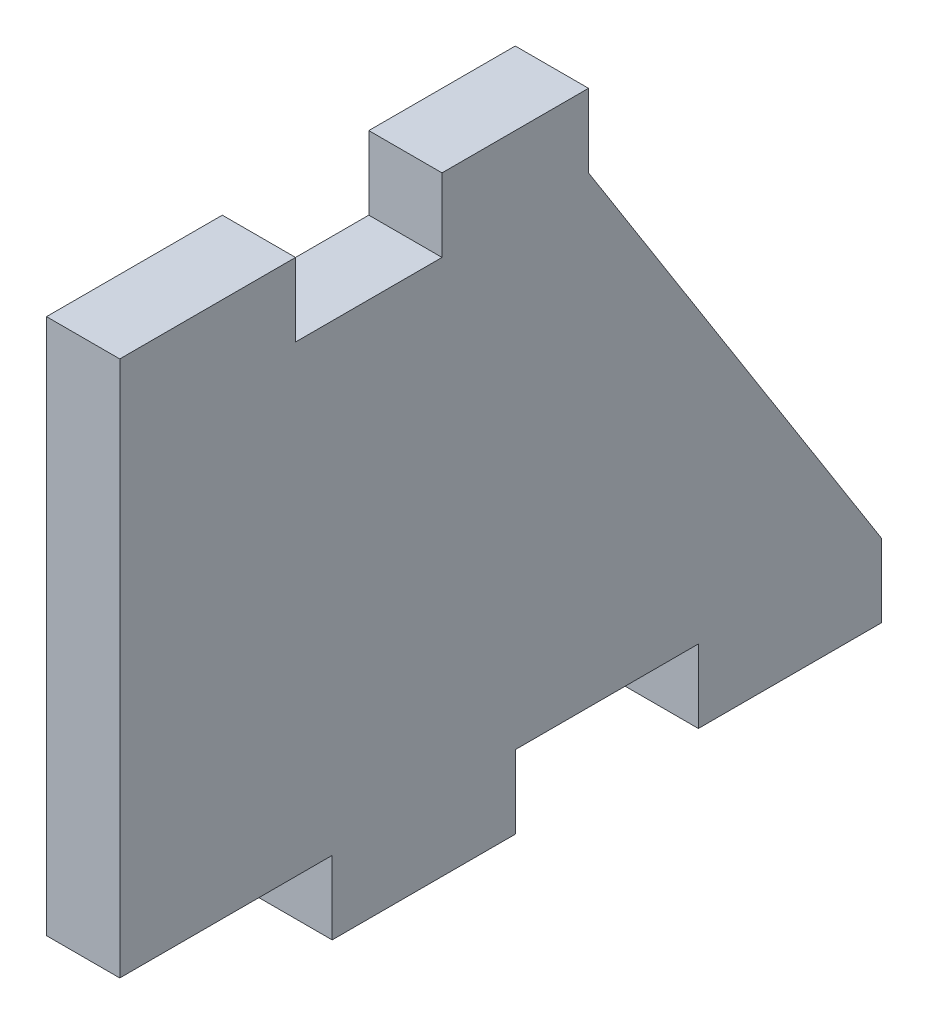
ISO-10303-21;
HEADER;
FILE_DESCRIPTION(('STEP AP214'),'2;1');
FILE_NAME('part.step','',(''),(''),'','','');
FILE_SCHEMA(('AUTOMOTIVE_DESIGN { 1 0 10303 214 1 1 1 1 }'));
ENDSEC;
DATA;
#1=APPLICATION_CONTEXT('core data for automotive mechanical design processes');
#2=APPLICATION_PROTOCOL_DEFINITION('international standard','automotive_design',2000,#1);
#3=PRODUCT_CONTEXT('',#1,'mechanical');
#4=PRODUCT('Part','Part','',(#3));
#5=PRODUCT_RELATED_PRODUCT_CATEGORY('part','',(#4));
#6=PRODUCT_DEFINITION_FORMATION('','',#4);
#7=PRODUCT_DEFINITION_CONTEXT('part definition',#1,'design');
#8=PRODUCT_DEFINITION('design','',#6,#7);
#9=PRODUCT_DEFINITION_SHAPE('','',#8);
#10=(LENGTH_UNIT() NAMED_UNIT(*) SI_UNIT(.MILLI.,.METRE.));
#11=(NAMED_UNIT(*) PLANE_ANGLE_UNIT() SI_UNIT($,.RADIAN.));
#12=(NAMED_UNIT(*) SI_UNIT($,.STERADIAN.) SOLID_ANGLE_UNIT());
#13=UNCERTAINTY_MEASURE_WITH_UNIT(LENGTH_MEASURE(1.E-05),#10,'distance_accuracy_value','');
#14=(GEOMETRIC_REPRESENTATION_CONTEXT(3) GLOBAL_UNCERTAINTY_ASSIGNED_CONTEXT((#13)) GLOBAL_UNIT_ASSIGNED_CONTEXT((#10,
#11,#12)) REPRESENTATION_CONTEXT('',''));
#15=CARTESIAN_POINT('',(0.,0.,0.));
#16=DIRECTION('',(0.,0.,1.));
#17=DIRECTION('',(1.,0.,0.));
#18=AXIS2_PLACEMENT_3D('',#15,#16,#17);
#19=CARTESIAN_POINT('',(6.35,-20.066,31.75));
#20=DIRECTION('',(0.,1.,0.));
#21=DIRECTION('',(0.,0.,1.));
#22=AXIS2_PLACEMENT_3D('',#19,#20,#21);
#23=PLANE('',#22);
#24=DIRECTION('',(-1.,0.,0.));
#25=VECTOR('',#24,1.);
#26=CARTESIAN_POINT('',(6.35,-20.066,15.875));
#27=LINE('',#26,#25);
#28=CARTESIAN_POINT('',(6.35,-20.066,15.875));
#29=VERTEX_POINT('',#28);
#30=CARTESIAN_POINT('',(0.,-20.066,15.875));
#31=VERTEX_POINT('',#30);
#32=EDGE_CURVE('E208',#29,#31,#27,.T.);
#33=ORIENTED_EDGE('',*,*,#32,.F.);
#34=DIRECTION('',(0.,0.,-1.));
#35=VECTOR('',#34,1.);
#36=CARTESIAN_POINT('',(6.35,-20.066,31.75));
#37=LINE('',#36,#35);
#38=CARTESIAN_POINT('',(6.35,-20.066,34.29));
#39=VERTEX_POINT('',#38);
#40=EDGE_CURVE('E43',#39,#29,#37,.T.);
#41=ORIENTED_EDGE('',*,*,#40,.F.);
#42=DIRECTION('',(1.,0.,0.));
#43=VECTOR('',#42,1.);
#44=CARTESIAN_POINT('',(0.,-20.066,34.29));
#45=LINE('',#44,#43);
#46=CARTESIAN_POINT('',(0.,-20.066,34.29));
#47=VERTEX_POINT('',#46);
#48=EDGE_CURVE('E170',#47,#39,#45,.T.);
#49=ORIENTED_EDGE('',*,*,#48,.F.);
#50=DIRECTION('',(0.,0.,-1.));
#51=VECTOR('',#50,1.);
#52=CARTESIAN_POINT('',(0.,-20.066,31.75));
#53=LINE('',#52,#51);
#54=EDGE_CURVE('E175',#47,#31,#53,.T.);
#55=ORIENTED_EDGE('',*,*,#54,.T.);
#56=EDGE_LOOP('',(#33,#41,#49,#55));
#57=FACE_BOUND('',#56,.T.);
#58=ADVANCED_FACE('F34',(#57),#23,.F.);
#59=CARTESIAN_POINT('',(6.35,20.066,31.75));
#60=DIRECTION('',(0.,-1.,0.));
#61=DIRECTION('',(0.,0.,-1.));
#62=AXIS2_PLACEMENT_3D('',#59,#60,#61);
#63=PLANE('',#62);
#64=DIRECTION('',(0.,0.,1.));
#65=VECTOR('',#64,1.);
#66=CARTESIAN_POINT('',(6.35,20.066,31.75));
#67=LINE('',#66,#65);
#68=CARTESIAN_POINT('',(6.35,20.066,6.35000000000002));
#69=VERTEX_POINT('',#68);
#70=CARTESIAN_POINT('',(6.35,20.066,19.05));
#71=VERTEX_POINT('',#70);
#72=EDGE_CURVE('E59',#69,#71,#67,.T.);
#73=ORIENTED_EDGE('',*,*,#72,.F.);
#74=DIRECTION('',(-1.,0.,0.));
#75=VECTOR('',#74,1.);
#76=CARTESIAN_POINT('',(6.35,20.066,6.35000000000002));
#77=LINE('',#76,#75);
#78=CARTESIAN_POINT('',(0.,20.066,6.35000000000002));
#79=VERTEX_POINT('',#78);
#80=EDGE_CURVE('E310',#69,#79,#77,.T.);
#81=ORIENTED_EDGE('',*,*,#80,.T.);
#82=DIRECTION('',(0.,0.,1.));
#83=VECTOR('',#82,1.);
#84=CARTESIAN_POINT('',(0.,20.066,31.75));
#85=LINE('',#84,#83);
#86=CARTESIAN_POINT('',(0.,20.066,19.05));
#87=VERTEX_POINT('',#86);
#88=EDGE_CURVE('E255',#79,#87,#85,.T.);
#89=ORIENTED_EDGE('',*,*,#88,.T.);
#90=DIRECTION('',(-1.,0.,0.));
#91=VECTOR('',#90,1.);
#92=CARTESIAN_POINT('',(6.35,20.066,19.05));
#93=LINE('',#92,#91);
#94=EDGE_CURVE('E293',#71,#87,#93,.T.);
#95=ORIENTED_EDGE('',*,*,#94,.F.);
#96=EDGE_LOOP('',(#73,#81,#89,#95));
#97=FACE_BOUND('',#96,.T.);
#98=ADVANCED_FACE('F36',(#97),#63,.F.);
#99=CARTESIAN_POINT('',(0.,-20.066,0.));
#100=VERTEX_POINT('',#99);
#101=CARTESIAN_POINT('',(0.,-20.066,-15.875));
#102=VERTEX_POINT('',#101);
#103=EDGE_CURVE('E258',#100,#102,#53,.T.);
#104=ORIENTED_EDGE('',*,*,#103,.T.);
#105=DIRECTION('',(-1.,0.,0.));
#106=VECTOR('',#105,1.);
#107=CARTESIAN_POINT('',(6.35,-20.066,-15.875));
#108=LINE('',#107,#106);
#109=CARTESIAN_POINT('',(6.35,-20.066,-15.875));
#110=VERTEX_POINT('',#109);
#111=EDGE_CURVE('E199',#110,#102,#108,.T.);
#112=ORIENTED_EDGE('',*,*,#111,.F.);
#113=CARTESIAN_POINT('',(6.35,-20.066,0.));
#114=VERTEX_POINT('',#113);
#115=EDGE_CURVE('E240',#114,#110,#37,.T.);
#116=ORIENTED_EDGE('',*,*,#115,.F.);
#117=DIRECTION('',(-1.,0.,0.));
#118=VECTOR('',#117,1.);
#119=CARTESIAN_POINT('',(6.35,-20.066,0.));
#120=LINE('',#119,#118);
#121=EDGE_CURVE('E219',#114,#100,#120,.T.);
#122=ORIENTED_EDGE('',*,*,#121,.T.);
#123=EDGE_LOOP('',(#104,#112,#116,#122));
#124=FACE_BOUND('',#123,.T.);
#125=ADVANCED_FACE('F266',(#124),#23,.F.);
#126=CARTESIAN_POINT('',(6.35,20.066,-31.75));
#127=DIRECTION('',(-1.,0.,0.));
#128=DIRECTION('',(0.,0.,1.));
#129=AXIS2_PLACEMENT_3D('',#126,#127,#128);
#130=PLANE('',#129);
#131=DIRECTION('',(0.,0.,-1.));
#132=VECTOR('',#131,1.);
#133=CARTESIAN_POINT('',(6.35,26.416,31.75));
#134=LINE('',#133,#132);
#135=CARTESIAN_POINT('',(6.35,26.416,34.29));
#136=VERTEX_POINT('',#135);
#137=CARTESIAN_POINT('',(6.35,26.416,19.05));
#138=VERTEX_POINT('',#137);
#139=EDGE_CURVE('E304',#136,#138,#134,.T.);
#140=ORIENTED_EDGE('',*,*,#139,.F.);
#141=DIRECTION('',(0.,-1.,0.));
#142=VECTOR('',#141,1.);
#143=CARTESIAN_POINT('',(6.35,26.416,34.29));
#144=LINE('',#143,#142);
#145=EDGE_CURVE('E169',#136,#39,#144,.T.);
#146=ORIENTED_EDGE('',*,*,#145,.T.);
#147=ORIENTED_EDGE('',*,*,#40,.T.);
#148=DIRECTION('',(0.,1.,0.));
#149=VECTOR('',#148,1.);
#150=CARTESIAN_POINT('',(6.35,-20.066,15.875));
#151=LINE('',#150,#149);
#152=CARTESIAN_POINT('',(6.35,-26.416,15.875));
#153=VERTEX_POINT('',#152);
#154=EDGE_CURVE('E213',#153,#29,#151,.T.);
#155=ORIENTED_EDGE('',*,*,#154,.F.);
#156=DIRECTION('',(0.,0.,1.));
#157=VECTOR('',#156,1.);
#158=CARTESIAN_POINT('',(6.35,-26.416,15.875));
#159=LINE('',#158,#157);
#160=CARTESIAN_POINT('',(6.35,-26.416,0.));
#161=VERTEX_POINT('',#160);
#162=EDGE_CURVE('E205',#161,#153,#159,.T.);
#163=ORIENTED_EDGE('',*,*,#162,.F.);
#164=DIRECTION('',(0.,-1.,0.));
#165=VECTOR('',#164,1.);
#166=CARTESIAN_POINT('',(6.35,-20.066,0.));
#167=LINE('',#166,#165);
#168=EDGE_CURVE('E209',#114,#161,#167,.T.);
#169=ORIENTED_EDGE('',*,*,#168,.F.);
#170=ORIENTED_EDGE('',*,*,#115,.T.);
#171=DIRECTION('',(0.,1.,0.));
#172=VECTOR('',#171,1.);
#173=CARTESIAN_POINT('',(6.35,-20.066,-15.875));
#174=LINE('',#173,#172);
#175=CARTESIAN_POINT('',(6.35,-26.416,-15.875));
#176=VERTEX_POINT('',#175);
#177=EDGE_CURVE('E189',#176,#110,#174,.T.);
#178=ORIENTED_EDGE('',*,*,#177,.F.);
#179=DIRECTION('',(0.,0.,1.));
#180=VECTOR('',#179,1.);
#181=CARTESIAN_POINT('',(6.35,-26.416,-31.75));
#182=LINE('',#181,#180);
#183=CARTESIAN_POINT('',(6.35,-26.416,-31.75));
#184=VERTEX_POINT('',#183);
#185=EDGE_CURVE('E185',#184,#176,#182,.T.);
#186=ORIENTED_EDGE('',*,*,#185,.F.);
#187=DIRECTION('',(0.,-1.,0.));
#188=VECTOR('',#187,1.);
#189=CARTESIAN_POINT('',(6.35,-20.066,-31.75));
#190=LINE('',#189,#188);
#191=CARTESIAN_POINT('',(6.35,-20.066,-31.75));
#192=VERTEX_POINT('',#191);
#193=EDGE_CURVE('E182',#192,#184,#190,.T.);
#194=ORIENTED_EDGE('',*,*,#193,.F.);
#195=DIRECTION('',(0.,0.84498019748951,0.534797593347791));
#196=VECTOR('',#195,1.);
#197=CARTESIAN_POINT('',(6.35,-20.066,-31.75));
#198=LINE('',#197,#196);
#199=CARTESIAN_POINT('',(6.35,20.066,-6.34999999999998));
#200=VERTEX_POINT('',#199);
#201=EDGE_CURVE('E285',#192,#200,#198,.T.);
#202=ORIENTED_EDGE('',*,*,#201,.T.);
#203=DIRECTION('',(0.,-1.,0.));
#204=VECTOR('',#203,1.);
#205=CARTESIAN_POINT('',(6.35,20.066,-6.34999999999998));
#206=LINE('',#205,#204);
#207=CARTESIAN_POINT('',(6.35,26.416,-6.34999999999998));
#208=VERTEX_POINT('',#207);
#209=EDGE_CURVE('E319',#208,#200,#206,.T.);
#210=ORIENTED_EDGE('',*,*,#209,.F.);
#211=DIRECTION('',(0.,0.,-1.));
#212=VECTOR('',#211,1.);
#213=CARTESIAN_POINT('',(6.35,26.416,-6.34999999999998));
#214=LINE('',#213,#212);
#215=CARTESIAN_POINT('',(6.35,26.416,6.35000000000002));
#216=VERTEX_POINT('',#215);
#217=EDGE_CURVE('E313',#216,#208,#214,.T.);
#218=ORIENTED_EDGE('',*,*,#217,.F.);
#219=DIRECTION('',(0.,1.,0.));
#220=VECTOR('',#219,1.);
#221=CARTESIAN_POINT('',(6.35,20.066,6.35000000000002));
#222=LINE('',#221,#220);
#223=EDGE_CURVE('E327',#69,#216,#222,.T.);
#224=ORIENTED_EDGE('',*,*,#223,.F.);
#225=ORIENTED_EDGE('',*,*,#72,.T.);
#226=DIRECTION('',(0.,-1.,0.));
#227=VECTOR('',#226,1.);
#228=CARTESIAN_POINT('',(6.35,20.066,19.05));
#229=LINE('',#228,#227);
#230=EDGE_CURVE('E297',#138,#71,#229,.T.);
#231=ORIENTED_EDGE('',*,*,#230,.F.);
#232=EDGE_LOOP('',(#140,#146,#147,#155,#163,#169,#170,#178,#186,#194,#202,#210,#218,#224,#225,#231));
#233=FACE_BOUND('',#232,.T.);
#234=ADVANCED_FACE('F275',(#233),#130,.F.);
#235=CARTESIAN_POINT('',(0.,20.066,-31.75));
#236=DIRECTION('',(-1.,0.,0.));
#237=DIRECTION('',(0.,0.,1.));
#238=AXIS2_PLACEMENT_3D('',#235,#236,#237);
#239=PLANE('',#238);
#240=ORIENTED_EDGE('',*,*,#54,.F.);
#241=DIRECTION('',(0.,-1.,0.));
#242=VECTOR('',#241,1.);
#243=CARTESIAN_POINT('',(0.,26.416,34.29));
#244=LINE('',#243,#242);
#245=CARTESIAN_POINT('',(0.,26.416,34.29));
#246=VERTEX_POINT('',#245);
#247=EDGE_CURVE('E167',#246,#47,#244,.T.);
#248=ORIENTED_EDGE('',*,*,#247,.F.);
#249=DIRECTION('',(0.,0.,-1.));
#250=VECTOR('',#249,1.);
#251=CARTESIAN_POINT('',(0.,26.416,31.75));
#252=LINE('',#251,#250);
#253=CARTESIAN_POINT('',(0.,26.416,19.05));
#254=VERTEX_POINT('',#253);
#255=EDGE_CURVE('E149',#246,#254,#252,.T.);
#256=ORIENTED_EDGE('',*,*,#255,.T.);
#257=DIRECTION('',(0.,-1.,0.));
#258=VECTOR('',#257,1.);
#259=CARTESIAN_POINT('',(0.,20.066,19.05));
#260=LINE('',#259,#258);
#261=EDGE_CURVE('E160',#254,#87,#260,.T.);
#262=ORIENTED_EDGE('',*,*,#261,.T.);
#263=ORIENTED_EDGE('',*,*,#88,.F.);
#264=DIRECTION('',(0.,1.,0.));
#265=VECTOR('',#264,1.);
#266=CARTESIAN_POINT('',(0.,20.066,6.35000000000002));
#267=LINE('',#266,#265);
#268=CARTESIAN_POINT('',(0.,26.416,6.35000000000002));
#269=VERTEX_POINT('',#268);
#270=EDGE_CURVE('E320',#79,#269,#267,.T.);
#271=ORIENTED_EDGE('',*,*,#270,.T.);
#272=DIRECTION('',(0.,0.,-1.));
#273=VECTOR('',#272,1.);
#274=CARTESIAN_POINT('',(0.,26.416,-6.34999999999998));
#275=LINE('',#274,#273);
#276=CARTESIAN_POINT('',(0.,26.416,-6.34999999999998));
#277=VERTEX_POINT('',#276);
#278=EDGE_CURVE('E316',#269,#277,#275,.T.);
#279=ORIENTED_EDGE('',*,*,#278,.T.);
#280=DIRECTION('',(0.,-1.,0.));
#281=VECTOR('',#280,1.);
#282=CARTESIAN_POINT('',(0.,20.066,-6.34999999999998));
#283=LINE('',#282,#281);
#284=CARTESIAN_POINT('',(0.,20.066,-6.34999999999998));
#285=VERTEX_POINT('',#284);
#286=EDGE_CURVE('E216',#277,#285,#283,.T.);
#287=ORIENTED_EDGE('',*,*,#286,.T.);
#288=DIRECTION('',(0.,0.84498019748951,0.534797593347791));
#289=VECTOR('',#288,1.);
#290=CARTESIAN_POINT('',(0.,-20.066,-31.75));
#291=LINE('',#290,#289);
#292=CARTESIAN_POINT('',(0.,-20.066,-31.75));
#293=VERTEX_POINT('',#292);
#294=EDGE_CURVE('E291',#293,#285,#291,.T.);
#295=ORIENTED_EDGE('',*,*,#294,.F.);
#296=DIRECTION('',(0.,-1.,0.));
#297=VECTOR('',#296,1.);
#298=CARTESIAN_POINT('',(0.,-20.066,-31.75));
#299=LINE('',#298,#297);
#300=CARTESIAN_POINT('',(0.,-26.416,-31.75));
#301=VERTEX_POINT('',#300);
#302=EDGE_CURVE('E180',#293,#301,#299,.T.);
#303=ORIENTED_EDGE('',*,*,#302,.T.);
#304=DIRECTION('',(0.,0.,1.));
#305=VECTOR('',#304,1.);
#306=CARTESIAN_POINT('',(0.,-26.416,-31.75));
#307=LINE('',#306,#305);
#308=CARTESIAN_POINT('',(0.,-26.416,-15.875));
#309=VERTEX_POINT('',#308);
#310=EDGE_CURVE('E194',#301,#309,#307,.T.);
#311=ORIENTED_EDGE('',*,*,#310,.T.);
#312=DIRECTION('',(0.,1.,0.));
#313=VECTOR('',#312,1.);
#314=CARTESIAN_POINT('',(0.,-20.066,-15.875));
#315=LINE('',#314,#313);
#316=EDGE_CURVE('E186',#309,#102,#315,.T.);
#317=ORIENTED_EDGE('',*,*,#316,.T.);
#318=ORIENTED_EDGE('',*,*,#103,.F.);
#319=DIRECTION('',(0.,-1.,0.));
#320=VECTOR('',#319,1.);
#321=CARTESIAN_POINT('',(0.,-20.066,0.));
#322=LINE('',#321,#320);
#323=CARTESIAN_POINT('',(0.,-26.416,0.));
#324=VERTEX_POINT('',#323);
#325=EDGE_CURVE('E51',#100,#324,#322,.T.);
#326=ORIENTED_EDGE('',*,*,#325,.T.);
#327=DIRECTION('',(0.,0.,1.));
#328=VECTOR('',#327,1.);
#329=CARTESIAN_POINT('',(0.,-26.416,15.875));
#330=LINE('',#329,#328);
#331=CARTESIAN_POINT('',(0.,-26.416,15.875));
#332=VERTEX_POINT('',#331);
#333=EDGE_CURVE('E210',#324,#332,#330,.T.);
#334=ORIENTED_EDGE('',*,*,#333,.T.);
#335=DIRECTION('',(0.,1.,0.));
#336=VECTOR('',#335,1.);
#337=CARTESIAN_POINT('',(0.,-20.066,15.875));
#338=LINE('',#337,#336);
#339=EDGE_CURVE('E201',#332,#31,#338,.T.);
#340=ORIENTED_EDGE('',*,*,#339,.T.);
#341=EDGE_LOOP('',(#240,#248,#256,#262,#263,#271,#279,#287,#295,#303,#311,#317,#318,#326,#334,#340));
#342=FACE_BOUND('',#341,.T.);
#343=ADVANCED_FACE('F172',(#342),#239,.T.);
#344=CARTESIAN_POINT('',(6.35,-20.066,-31.75));
#345=DIRECTION('',(0.,-0.534797593347791,0.84498019748951));
#346=DIRECTION('',(0.,-0.84498019748951,-0.534797593347791));
#347=AXIS2_PLACEMENT_3D('',#344,#345,#346);
#348=PLANE('',#347);
#349=ORIENTED_EDGE('',*,*,#294,.T.);
#350=DIRECTION('',(-1.,0.,0.));
#351=VECTOR('',#350,1.);
#352=CARTESIAN_POINT('',(6.35,20.066,-6.34999999999998));
#353=LINE('',#352,#351);
#354=EDGE_CURVE('E259',#200,#285,#353,.T.);
#355=ORIENTED_EDGE('',*,*,#354,.F.);
#356=ORIENTED_EDGE('',*,*,#201,.F.);
#357=DIRECTION('',(-1.,0.,0.));
#358=VECTOR('',#357,1.);
#359=CARTESIAN_POINT('',(6.35,-20.066,-31.75));
#360=LINE('',#359,#358);
#361=EDGE_CURVE('E11',#192,#293,#360,.T.);
#362=ORIENTED_EDGE('',*,*,#361,.T.);
#363=EDGE_LOOP('',(#349,#355,#356,#362));
#364=FACE_BOUND('',#363,.T.);
#365=ADVANCED_FACE('F288',(#364),#348,.F.);
#366=CARTESIAN_POINT('',(6.35,20.066,19.05));
#367=DIRECTION('',(0.,0.,-1.));
#368=DIRECTION('',(-1.,0.,0.));
#369=AXIS2_PLACEMENT_3D('',#366,#367,#368);
#370=PLANE('',#369);
#371=ORIENTED_EDGE('',*,*,#261,.F.);
#372=DIRECTION('',(-1.,0.,0.));
#373=VECTOR('',#372,1.);
#374=CARTESIAN_POINT('',(6.35,26.416,19.05));
#375=LINE('',#374,#373);
#376=EDGE_CURVE('E155',#138,#254,#375,.T.);
#377=ORIENTED_EDGE('',*,*,#376,.F.);
#378=ORIENTED_EDGE('',*,*,#230,.T.);
#379=ORIENTED_EDGE('',*,*,#94,.T.);
#380=EDGE_LOOP('',(#371,#377,#378,#379));
#381=FACE_BOUND('',#380,.T.);
#382=ADVANCED_FACE('F341',(#381),#370,.T.);
#383=CARTESIAN_POINT('',(6.35,26.416,31.75));
#384=DIRECTION('',(0.,1.,0.));
#385=DIRECTION('',(0.,0.,1.));
#386=AXIS2_PLACEMENT_3D('',#383,#384,#385);
#387=PLANE('',#386);
#388=ORIENTED_EDGE('',*,*,#255,.F.);
#389=DIRECTION('',(1.,0.,0.));
#390=VECTOR('',#389,1.);
#391=CARTESIAN_POINT('',(0.,26.416,34.29));
#392=LINE('',#391,#390);
#393=EDGE_CURVE('E153',#246,#136,#392,.T.);
#394=ORIENTED_EDGE('',*,*,#393,.T.);
#395=ORIENTED_EDGE('',*,*,#139,.T.);
#396=ORIENTED_EDGE('',*,*,#376,.T.);
#397=EDGE_LOOP('',(#388,#394,#395,#396));
#398=FACE_BOUND('',#397,.T.);
#399=ADVANCED_FACE('F151',(#398),#387,.T.);
#400=CARTESIAN_POINT('',(6.35,20.066,-6.34999999999998));
#401=DIRECTION('',(0.,0.,-1.));
#402=DIRECTION('',(-1.,0.,0.));
#403=AXIS2_PLACEMENT_3D('',#400,#401,#402);
#404=PLANE('',#403);
#405=ORIENTED_EDGE('',*,*,#286,.F.);
#406=DIRECTION('',(-1.,0.,0.));
#407=VECTOR('',#406,1.);
#408=CARTESIAN_POINT('',(6.35,26.416,-6.34999999999998));
#409=LINE('',#408,#407);
#410=EDGE_CURVE('E161',#208,#277,#409,.T.);
#411=ORIENTED_EDGE('',*,*,#410,.F.);
#412=ORIENTED_EDGE('',*,*,#209,.T.);
#413=ORIENTED_EDGE('',*,*,#354,.T.);
#414=EDGE_LOOP('',(#405,#411,#412,#413));
#415=FACE_BOUND('',#414,.T.);
#416=ADVANCED_FACE('F331',(#415),#404,.T.);
#417=CARTESIAN_POINT('',(6.35,26.416,-6.34999999999998));
#418=DIRECTION('',(0.,1.,0.));
#419=DIRECTION('',(0.,0.,1.));
#420=AXIS2_PLACEMENT_3D('',#417,#418,#419);
#421=PLANE('',#420);
#422=ORIENTED_EDGE('',*,*,#278,.F.);
#423=DIRECTION('',(-1.,0.,0.));
#424=VECTOR('',#423,1.);
#425=CARTESIAN_POINT('',(6.35,26.416,6.35000000000002));
#426=LINE('',#425,#424);
#427=EDGE_CURVE('E312',#216,#269,#426,.T.);
#428=ORIENTED_EDGE('',*,*,#427,.F.);
#429=ORIENTED_EDGE('',*,*,#217,.T.);
#430=ORIENTED_EDGE('',*,*,#410,.T.);
#431=EDGE_LOOP('',(#422,#428,#429,#430));
#432=FACE_BOUND('',#431,.T.);
#433=ADVANCED_FACE('F336',(#432),#421,.T.);
#434=CARTESIAN_POINT('',(6.35,20.066,6.35000000000002));
#435=DIRECTION('',(0.,0.,1.));
#436=DIRECTION('',(1.,0.,0.));
#437=AXIS2_PLACEMENT_3D('',#434,#435,#436);
#438=PLANE('',#437);
#439=ORIENTED_EDGE('',*,*,#270,.F.);
#440=ORIENTED_EDGE('',*,*,#80,.F.);
#441=ORIENTED_EDGE('',*,*,#223,.T.);
#442=ORIENTED_EDGE('',*,*,#427,.T.);
#443=EDGE_LOOP('',(#439,#440,#441,#442));
#444=FACE_BOUND('',#443,.T.);
#445=ADVANCED_FACE('F339',(#444),#438,.T.);
#446=CARTESIAN_POINT('',(6.35,-20.066,15.875));
#447=DIRECTION('',(0.,0.,1.));
#448=DIRECTION('',(1.,0.,0.));
#449=AXIS2_PLACEMENT_3D('',#446,#447,#448);
#450=PLANE('',#449);
#451=ORIENTED_EDGE('',*,*,#339,.F.);
#452=DIRECTION('',(-1.,0.,0.));
#453=VECTOR('',#452,1.);
#454=CARTESIAN_POINT('',(6.35,-26.416,15.875));
#455=LINE('',#454,#453);
#456=EDGE_CURVE('E214',#153,#332,#455,.T.);
#457=ORIENTED_EDGE('',*,*,#456,.F.);
#458=ORIENTED_EDGE('',*,*,#154,.T.);
#459=ORIENTED_EDGE('',*,*,#32,.T.);
#460=EDGE_LOOP('',(#451,#457,#458,#459));
#461=FACE_BOUND('',#460,.T.);
#462=ADVANCED_FACE('F450',(#461),#450,.T.);
#463=CARTESIAN_POINT('',(6.35,-26.416,15.875));
#464=DIRECTION('',(0.,-1.,0.));
#465=DIRECTION('',(0.,0.,-1.));
#466=AXIS2_PLACEMENT_3D('',#463,#464,#465);
#467=PLANE('',#466);
#468=ORIENTED_EDGE('',*,*,#333,.F.);
#469=DIRECTION('',(-1.,0.,0.));
#470=VECTOR('',#469,1.);
#471=CARTESIAN_POINT('',(6.35,-26.416,0.));
#472=LINE('',#471,#470);
#473=EDGE_CURVE('E217',#161,#324,#472,.T.);
#474=ORIENTED_EDGE('',*,*,#473,.F.);
#475=ORIENTED_EDGE('',*,*,#162,.T.);
#476=ORIENTED_EDGE('',*,*,#456,.T.);
#477=EDGE_LOOP('',(#468,#474,#475,#476));
#478=FACE_BOUND('',#477,.T.);
#479=ADVANCED_FACE('F442',(#478),#467,.T.);
#480=CARTESIAN_POINT('',(6.35,-20.066,0.));
#481=DIRECTION('',(0.,0.,-1.));
#482=DIRECTION('',(0.,1.,0.));
#483=AXIS2_PLACEMENT_3D('',#480,#481,#482);
#484=PLANE('',#483);
#485=ORIENTED_EDGE('',*,*,#325,.F.);
#486=ORIENTED_EDGE('',*,*,#121,.F.);
#487=ORIENTED_EDGE('',*,*,#168,.T.);
#488=ORIENTED_EDGE('',*,*,#473,.T.);
#489=EDGE_LOOP('',(#485,#486,#487,#488));
#490=FACE_BOUND('',#489,.T.);
#491=ADVANCED_FACE('F434',(#490),#484,.T.);
#492=CARTESIAN_POINT('',(6.35,-20.066,-31.75));
#493=DIRECTION('',(0.,0.,-1.));
#494=DIRECTION('',(-1.,0.,0.));
#495=AXIS2_PLACEMENT_3D('',#492,#493,#494);
#496=PLANE('',#495);
#497=ORIENTED_EDGE('',*,*,#302,.F.);
#498=ORIENTED_EDGE('',*,*,#361,.F.);
#499=ORIENTED_EDGE('',*,*,#193,.T.);
#500=DIRECTION('',(-1.,0.,0.));
#501=VECTOR('',#500,1.);
#502=CARTESIAN_POINT('',(6.35,-26.416,-31.75));
#503=LINE('',#502,#501);
#504=EDGE_CURVE('E191',#184,#301,#503,.T.);
#505=ORIENTED_EDGE('',*,*,#504,.T.);
#506=EDGE_LOOP('',(#497,#498,#499,#505));
#507=FACE_BOUND('',#506,.T.);
#508=ADVANCED_FACE('F281',(#507),#496,.T.);
#509=CARTESIAN_POINT('',(6.35,-20.066,-15.875));
#510=DIRECTION('',(0.,0.,1.));
#511=DIRECTION('',(1.,0.,0.));
#512=AXIS2_PLACEMENT_3D('',#509,#510,#511);
#513=PLANE('',#512);
#514=ORIENTED_EDGE('',*,*,#316,.F.);
#515=DIRECTION('',(-1.,0.,0.));
#516=VECTOR('',#515,1.);
#517=CARTESIAN_POINT('',(6.35,-26.416,-15.875));
#518=LINE('',#517,#516);
#519=EDGE_CURVE('E202',#176,#309,#518,.T.);
#520=ORIENTED_EDGE('',*,*,#519,.F.);
#521=ORIENTED_EDGE('',*,*,#177,.T.);
#522=ORIENTED_EDGE('',*,*,#111,.T.);
#523=EDGE_LOOP('',(#514,#520,#521,#522));
#524=FACE_BOUND('',#523,.T.);
#525=ADVANCED_FACE('F271',(#524),#513,.T.);
#526=CARTESIAN_POINT('',(6.35,-26.416,-31.75));
#527=DIRECTION('',(0.,-1.,0.));
#528=DIRECTION('',(0.,0.,-1.));
#529=AXIS2_PLACEMENT_3D('',#526,#527,#528);
#530=PLANE('',#529);
#531=ORIENTED_EDGE('',*,*,#310,.F.);
#532=ORIENTED_EDGE('',*,*,#504,.F.);
#533=ORIENTED_EDGE('',*,*,#185,.T.);
#534=ORIENTED_EDGE('',*,*,#519,.T.);
#535=EDGE_LOOP('',(#531,#532,#533,#534));
#536=FACE_BOUND('',#535,.T.);
#537=ADVANCED_FACE('F279',(#536),#530,.T.);
#538=CARTESIAN_POINT('',(0.,26.416,34.29));
#539=DIRECTION('',(0.,0.,1.));
#540=DIRECTION('',(0.,-1.,0.));
#541=AXIS2_PLACEMENT_3D('',#538,#539,#540);
#542=PLANE('',#541);
#543=ORIENTED_EDGE('',*,*,#145,.F.);
#544=ORIENTED_EDGE('',*,*,#393,.F.);
#545=ORIENTED_EDGE('',*,*,#247,.T.);
#546=ORIENTED_EDGE('',*,*,#48,.T.);
#547=EDGE_LOOP('',(#543,#544,#545,#546));
#548=FACE_BOUND('',#547,.T.);
#549=ADVANCED_FACE('F165',(#548),#542,.T.);
#550=CLOSED_SHELL('',(#58,#98,#125,#234,#343,#365,#382,#399,#416,#433,#445,#462,#479,#491,#508,
#525,#537,#549));
#551=MANIFOLD_SOLID_BREP('B2',#550);
#552=ADVANCED_BREP_SHAPE_REPRESENTATION('',(#18,#551),#14);
#553=SHAPE_DEFINITION_REPRESENTATION(#9,#552);
ENDSEC;
END-ISO-10303-21;
